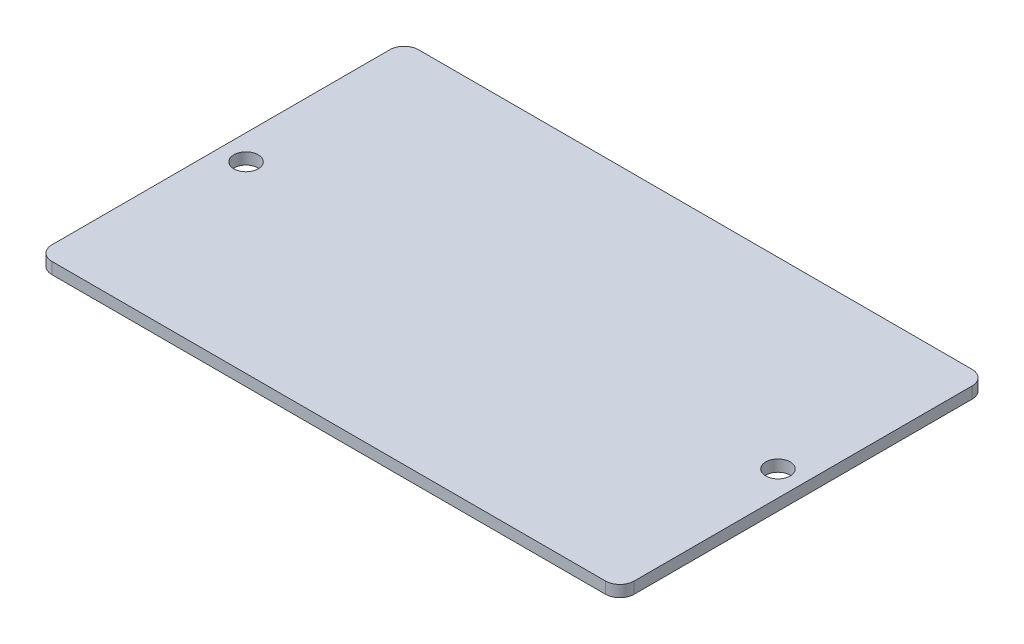
ISO-10303-21;
HEADER;
FILE_DESCRIPTION(('STEP AP214'),'2;1');
FILE_NAME('part.step','',(''),(''),'','','');
FILE_SCHEMA(('AUTOMOTIVE_DESIGN { 1 0 10303 214 1 1 1 1 }'));
ENDSEC;
DATA;
#1=APPLICATION_CONTEXT('core data for automotive mechanical design processes');
#2=APPLICATION_PROTOCOL_DEFINITION('international standard','automotive_design',2000,#1);
#3=PRODUCT_CONTEXT('',#1,'mechanical');
#4=PRODUCT('Part','Part','',(#3));
#5=PRODUCT_RELATED_PRODUCT_CATEGORY('part','',(#4));
#6=PRODUCT_DEFINITION_FORMATION('','',#4);
#7=PRODUCT_DEFINITION_CONTEXT('part definition',#1,'design');
#8=PRODUCT_DEFINITION('design','',#6,#7);
#9=PRODUCT_DEFINITION_SHAPE('','',#8);
#10=(LENGTH_UNIT() NAMED_UNIT(*) SI_UNIT(.MILLI.,.METRE.));
#11=(NAMED_UNIT(*) PLANE_ANGLE_UNIT() SI_UNIT($,.RADIAN.));
#12=(NAMED_UNIT(*) SI_UNIT($,.STERADIAN.) SOLID_ANGLE_UNIT());
#13=UNCERTAINTY_MEASURE_WITH_UNIT(LENGTH_MEASURE(1.E-05),#10,'distance_accuracy_value','');
#14=(GEOMETRIC_REPRESENTATION_CONTEXT(3) GLOBAL_UNCERTAINTY_ASSIGNED_CONTEXT((#13)) GLOBAL_UNIT_ASSIGNED_CONTEXT((#10,
#11,#12)) REPRESENTATION_CONTEXT('',''));
#15=CARTESIAN_POINT('',(0.,0.,0.));
#16=DIRECTION('',(0.,0.,1.));
#17=DIRECTION('',(1.,0.,0.));
#18=AXIS2_PLACEMENT_3D('',#15,#16,#17);
#19=CARTESIAN_POINT('',(0.,1.6,0.));
#20=DIRECTION('',(0.,1.,0.));
#21=DIRECTION('',(0.,0.,1.));
#22=AXIS2_PLACEMENT_3D('',#19,#20,#21);
#23=PLANE('',#22);
#24=CARTESIAN_POINT('',(-37.,1.6,0.));
#25=DIRECTION('',(0.,1.,0.));
#26=DIRECTION('',(0.,0.,1.));
#27=AXIS2_PLACEMENT_3D('',#24,#25,#26);
#28=CIRCLE('',#27,1.7);
#29=CARTESIAN_POINT('',(-37.,1.6,1.7));
#30=VERTEX_POINT('',#29);
#31=EDGE_CURVE('E208',#30,#30,#28,.T.);
#32=ORIENTED_EDGE('',*,*,#31,.F.);
#33=EDGE_LOOP('',(#32));
#34=FACE_BOUND('',#33,.T.);
#35=DIRECTION('',(-1.,0.,0.));
#36=VECTOR('',#35,1.);
#37=CARTESIAN_POINT('',(-40.5,1.6,-25.5));
#38=LINE('',#37,#36);
#39=CARTESIAN_POINT('',(38.5,1.6,-25.5));
#40=VERTEX_POINT('',#39);
#41=CARTESIAN_POINT('',(-38.5,1.6,-25.5));
#42=VERTEX_POINT('',#41);
#43=EDGE_CURVE('E195',#40,#42,#38,.T.);
#44=ORIENTED_EDGE('',*,*,#43,.T.);
#45=CARTESIAN_POINT('',(-38.5,1.6,-23.5));
#46=DIRECTION('',(0.,1.,0.));
#47=DIRECTION('',(0.,0.,1.));
#48=AXIS2_PLACEMENT_3D('',#45,#46,#47);
#49=CIRCLE('',#48,2.);
#50=CARTESIAN_POINT('',(-40.5,1.6,-23.5));
#51=VERTEX_POINT('',#50);
#52=EDGE_CURVE('E168',#42,#51,#49,.T.);
#53=ORIENTED_EDGE('',*,*,#52,.T.);
#54=DIRECTION('',(0.,0.,1.));
#55=VECTOR('',#54,1.);
#56=CARTESIAN_POINT('',(-40.5,1.6,-25.5));
#57=LINE('',#56,#55);
#58=CARTESIAN_POINT('',(-40.5,1.6,23.5));
#59=VERTEX_POINT('',#58);
#60=EDGE_CURVE('E125',#51,#59,#57,.T.);
#61=ORIENTED_EDGE('',*,*,#60,.T.);
#62=CARTESIAN_POINT('',(-38.5,1.6,23.5));
#63=DIRECTION('',(0.,1.,0.));
#64=DIRECTION('',(0.,0.,1.));
#65=AXIS2_PLACEMENT_3D('',#62,#63,#64);
#66=CIRCLE('',#65,2.);
#67=CARTESIAN_POINT('',(-38.5,1.6,25.5));
#68=VERTEX_POINT('',#67);
#69=EDGE_CURVE('E60',#59,#68,#66,.T.);
#70=ORIENTED_EDGE('',*,*,#69,.T.);
#71=DIRECTION('',(1.,0.,0.));
#72=VECTOR('',#71,1.);
#73=CARTESIAN_POINT('',(-40.5,1.6,25.5));
#74=LINE('',#73,#72);
#75=CARTESIAN_POINT('',(38.5,1.6,25.5));
#76=VERTEX_POINT('',#75);
#77=EDGE_CURVE('E146',#68,#76,#74,.T.);
#78=ORIENTED_EDGE('',*,*,#77,.T.);
#79=CARTESIAN_POINT('',(38.5,1.6,23.5));
#80=DIRECTION('',(0.,1.,0.));
#81=DIRECTION('',(0.,0.,1.));
#82=AXIS2_PLACEMENT_3D('',#79,#80,#81);
#83=CIRCLE('',#82,2.);
#84=CARTESIAN_POINT('',(40.5,1.6,23.5));
#85=VERTEX_POINT('',#84);
#86=EDGE_CURVE('E162',#76,#85,#83,.T.);
#87=ORIENTED_EDGE('',*,*,#86,.T.);
#88=DIRECTION('',(0.,0.,-1.));
#89=VECTOR('',#88,1.);
#90=CARTESIAN_POINT('',(40.5,1.6,-25.5));
#91=LINE('',#90,#89);
#92=CARTESIAN_POINT('',(40.5,1.6,-23.5));
#93=VERTEX_POINT('',#92);
#94=EDGE_CURVE('E139',#85,#93,#91,.T.);
#95=ORIENTED_EDGE('',*,*,#94,.T.);
#96=CARTESIAN_POINT('',(38.5,1.6,-23.5));
#97=DIRECTION('',(0.,1.,0.));
#98=DIRECTION('',(0.,0.,1.));
#99=AXIS2_PLACEMENT_3D('',#96,#97,#98);
#100=CIRCLE('',#99,2.);
#101=EDGE_CURVE('E165',#93,#40,#100,.T.);
#102=ORIENTED_EDGE('',*,*,#101,.T.);
#103=EDGE_LOOP('',(#44,#53,#61,#70,#78,#87,#95,#102));
#104=FACE_BOUND('',#103,.T.);
#105=CARTESIAN_POINT('',(37.,1.6,0.));
#106=DIRECTION('',(0.,1.,0.));
#107=DIRECTION('',(0.,0.,1.));
#108=AXIS2_PLACEMENT_3D('',#105,#106,#107);
#109=CIRCLE('',#108,1.7);
#110=CARTESIAN_POINT('',(37.,1.6,1.7));
#111=VERTEX_POINT('',#110);
#112=EDGE_CURVE('E215',#111,#111,#109,.T.);
#113=ORIENTED_EDGE('',*,*,#112,.F.);
#114=EDGE_LOOP('',(#113));
#115=FACE_BOUND('',#114,.T.);
#116=ADVANCED_FACE('F39',(#34,#104,#115),#23,.T.);
#117=CARTESIAN_POINT('',(0.,0.,0.));
#118=DIRECTION('',(0.,1.,0.));
#119=DIRECTION('',(0.,0.,1.));
#120=AXIS2_PLACEMENT_3D('',#117,#118,#119);
#121=PLANE('',#120);
#122=DIRECTION('',(0.,0.,1.));
#123=VECTOR('',#122,1.);
#124=CARTESIAN_POINT('',(-40.5,0.,-25.5));
#125=LINE('',#124,#123);
#126=CARTESIAN_POINT('',(-40.5,0.,-23.5));
#127=VERTEX_POINT('',#126);
#128=CARTESIAN_POINT('',(-40.5,0.,23.5));
#129=VERTEX_POINT('',#128);
#130=EDGE_CURVE('E123',#127,#129,#125,.T.);
#131=ORIENTED_EDGE('',*,*,#130,.F.);
#132=CARTESIAN_POINT('',(-38.5,0.,-23.5));
#133=DIRECTION('',(0.,1.,0.));
#134=DIRECTION('',(0.,0.,1.));
#135=AXIS2_PLACEMENT_3D('',#132,#133,#134);
#136=CIRCLE('',#135,2.);
#137=CARTESIAN_POINT('',(-38.5,0.,-25.5));
#138=VERTEX_POINT('',#137);
#139=EDGE_CURVE('E105',#127,#138,#136,.F.);
#140=ORIENTED_EDGE('',*,*,#139,.T.);
#141=DIRECTION('',(-1.,0.,0.));
#142=VECTOR('',#141,1.);
#143=CARTESIAN_POINT('',(-40.5,0.,-25.5));
#144=LINE('',#143,#142);
#145=CARTESIAN_POINT('',(38.5,0.,-25.5));
#146=VERTEX_POINT('',#145);
#147=EDGE_CURVE('E135',#146,#138,#144,.T.);
#148=ORIENTED_EDGE('',*,*,#147,.F.);
#149=CARTESIAN_POINT('',(38.5,0.,-23.5));
#150=DIRECTION('',(0.,1.,0.));
#151=DIRECTION('',(0.,0.,1.));
#152=AXIS2_PLACEMENT_3D('',#149,#150,#151);
#153=CIRCLE('',#152,2.);
#154=CARTESIAN_POINT('',(40.5,0.,-23.5));
#155=VERTEX_POINT('',#154);
#156=EDGE_CURVE('E117',#146,#155,#153,.F.);
#157=ORIENTED_EDGE('',*,*,#156,.T.);
#158=DIRECTION('',(0.,0.,-1.));
#159=VECTOR('',#158,1.);
#160=CARTESIAN_POINT('',(40.5,0.,-25.5));
#161=LINE('',#160,#159);
#162=CARTESIAN_POINT('',(40.5,0.,23.5));
#163=VERTEX_POINT('',#162);
#164=EDGE_CURVE('E141',#163,#155,#161,.T.);
#165=ORIENTED_EDGE('',*,*,#164,.F.);
#166=CARTESIAN_POINT('',(38.5,0.,23.5));
#167=DIRECTION('',(0.,1.,0.));
#168=DIRECTION('',(0.,0.,1.));
#169=AXIS2_PLACEMENT_3D('',#166,#167,#168);
#170=CIRCLE('',#169,2.);
#171=CARTESIAN_POINT('',(38.5,0.,25.5));
#172=VERTEX_POINT('',#171);
#173=EDGE_CURVE('E150',#163,#172,#170,.F.);
#174=ORIENTED_EDGE('',*,*,#173,.T.);
#175=DIRECTION('',(1.,0.,0.));
#176=VECTOR('',#175,1.);
#177=CARTESIAN_POINT('',(-40.5,0.,25.5));
#178=LINE('',#177,#176);
#179=CARTESIAN_POINT('',(-38.5,0.,25.5));
#180=VERTEX_POINT('',#179);
#181=EDGE_CURVE('E134',#180,#172,#178,.T.);
#182=ORIENTED_EDGE('',*,*,#181,.F.);
#183=CARTESIAN_POINT('',(-38.5,0.,23.5));
#184=DIRECTION('',(0.,1.,0.));
#185=DIRECTION('',(0.,0.,1.));
#186=AXIS2_PLACEMENT_3D('',#183,#184,#185);
#187=CIRCLE('',#186,2.);
#188=EDGE_CURVE('E127',#180,#129,#187,.F.);
#189=ORIENTED_EDGE('',*,*,#188,.T.);
#190=EDGE_LOOP('',(#131,#140,#148,#157,#165,#174,#182,#189));
#191=FACE_BOUND('',#190,.T.);
#192=CARTESIAN_POINT('',(-37.,0.,0.));
#193=DIRECTION('',(0.,1.,0.));
#194=DIRECTION('',(0.,0.,1.));
#195=AXIS2_PLACEMENT_3D('',#192,#193,#194);
#196=CIRCLE('',#195,1.7);
#197=CARTESIAN_POINT('',(-37.,0.,1.7));
#198=VERTEX_POINT('',#197);
#199=EDGE_CURVE('E201',#198,#198,#196,.T.);
#200=ORIENTED_EDGE('',*,*,#199,.T.);
#201=EDGE_LOOP('',(#200));
#202=FACE_BOUND('',#201,.T.);
#203=CARTESIAN_POINT('',(37.,0.,0.));
#204=DIRECTION('',(0.,1.,0.));
#205=DIRECTION('',(0.,0.,1.));
#206=AXIS2_PLACEMENT_3D('',#203,#204,#205);
#207=CIRCLE('',#206,1.7);
#208=CARTESIAN_POINT('',(37.,0.,1.7));
#209=VERTEX_POINT('',#208);
#210=EDGE_CURVE('E217',#209,#209,#207,.T.);
#211=ORIENTED_EDGE('',*,*,#210,.T.);
#212=EDGE_LOOP('',(#211));
#213=FACE_BOUND('',#212,.T.);
#214=ADVANCED_FACE('F130',(#191,#202,#213),#121,.F.);
#215=CARTESIAN_POINT('',(40.5,1.6,-25.5));
#216=DIRECTION('',(-1.,0.,0.));
#217=DIRECTION('',(0.,0.,1.));
#218=AXIS2_PLACEMENT_3D('',#215,#216,#217);
#219=PLANE('',#218);
#220=ORIENTED_EDGE('',*,*,#164,.T.);
#221=DIRECTION('',(0.,-1.,0.));
#222=VECTOR('',#221,1.);
#223=CARTESIAN_POINT('',(40.5,1.6,-23.5));
#224=LINE('',#223,#222);
#225=EDGE_CURVE('E175',#155,#93,#224,.F.);
#226=ORIENTED_EDGE('',*,*,#225,.T.);
#227=ORIENTED_EDGE('',*,*,#94,.F.);
#228=DIRECTION('',(0.,-1.,0.));
#229=VECTOR('',#228,1.);
#230=CARTESIAN_POINT('',(40.5,1.6,23.5));
#231=LINE('',#230,#229);
#232=EDGE_CURVE('E171',#85,#163,#231,.T.);
#233=ORIENTED_EDGE('',*,*,#232,.T.);
#234=EDGE_LOOP('',(#220,#226,#227,#233));
#235=FACE_BOUND('',#234,.T.);
#236=ADVANCED_FACE('F190',(#235),#219,.F.);
#237=CARTESIAN_POINT('',(-40.5,1.6,-25.5));
#238=DIRECTION('',(0.,0.,1.));
#239=DIRECTION('',(1.,0.,0.));
#240=AXIS2_PLACEMENT_3D('',#237,#238,#239);
#241=PLANE('',#240);
#242=ORIENTED_EDGE('',*,*,#147,.T.);
#243=DIRECTION('',(0.,-1.,0.));
#244=VECTOR('',#243,1.);
#245=CARTESIAN_POINT('',(-38.5,1.6,-25.5));
#246=LINE('',#245,#244);
#247=EDGE_CURVE('E110',#138,#42,#246,.F.);
#248=ORIENTED_EDGE('',*,*,#247,.T.);
#249=ORIENTED_EDGE('',*,*,#43,.F.);
#250=DIRECTION('',(0.,-1.,0.));
#251=VECTOR('',#250,1.);
#252=CARTESIAN_POINT('',(38.5,1.6,-25.5));
#253=LINE('',#252,#251);
#254=EDGE_CURVE('E116',#40,#146,#253,.T.);
#255=ORIENTED_EDGE('',*,*,#254,.T.);
#256=EDGE_LOOP('',(#242,#248,#249,#255));
#257=FACE_BOUND('',#256,.T.);
#258=ADVANCED_FACE('F243',(#257),#241,.F.);
#259=CARTESIAN_POINT('',(-40.5,1.6,-25.5));
#260=DIRECTION('',(1.,0.,0.));
#261=DIRECTION('',(0.,0.,-1.));
#262=AXIS2_PLACEMENT_3D('',#259,#260,#261);
#263=PLANE('',#262);
#264=ORIENTED_EDGE('',*,*,#60,.F.);
#265=DIRECTION('',(0.,-1.,0.));
#266=VECTOR('',#265,1.);
#267=CARTESIAN_POINT('',(-40.5,1.6,-23.5));
#268=LINE('',#267,#266);
#269=EDGE_CURVE('E109',#51,#127,#268,.T.);
#270=ORIENTED_EDGE('',*,*,#269,.T.);
#271=ORIENTED_EDGE('',*,*,#130,.T.);
#272=DIRECTION('',(0.,-1.,0.));
#273=VECTOR('',#272,1.);
#274=CARTESIAN_POINT('',(-40.5,1.6,23.5));
#275=LINE('',#274,#273);
#276=EDGE_CURVE('E128',#129,#59,#275,.F.);
#277=ORIENTED_EDGE('',*,*,#276,.T.);
#278=EDGE_LOOP('',(#264,#270,#271,#277));
#279=FACE_BOUND('',#278,.T.);
#280=ADVANCED_FACE('F122',(#279),#263,.F.);
#281=CARTESIAN_POINT('',(-40.5,1.6,25.5));
#282=DIRECTION('',(0.,0.,-1.));
#283=DIRECTION('',(-1.,0.,0.));
#284=AXIS2_PLACEMENT_3D('',#281,#282,#283);
#285=PLANE('',#284);
#286=ORIENTED_EDGE('',*,*,#181,.T.);
#287=DIRECTION('',(0.,-1.,0.));
#288=VECTOR('',#287,1.);
#289=CARTESIAN_POINT('',(38.5,1.6,25.5));
#290=LINE('',#289,#288);
#291=EDGE_CURVE('E11',#172,#76,#290,.F.);
#292=ORIENTED_EDGE('',*,*,#291,.T.);
#293=ORIENTED_EDGE('',*,*,#77,.F.);
#294=DIRECTION('',(0.,-1.,0.));
#295=VECTOR('',#294,1.);
#296=CARTESIAN_POINT('',(-38.5,1.6,25.5));
#297=LINE('',#296,#295);
#298=EDGE_CURVE('E48',#68,#180,#297,.T.);
#299=ORIENTED_EDGE('',*,*,#298,.T.);
#300=EDGE_LOOP('',(#286,#292,#293,#299));
#301=FACE_BOUND('',#300,.T.);
#302=ADVANCED_FACE('F180',(#301),#285,.F.);
#303=CARTESIAN_POINT('',(-37.,1.6,0.));
#304=DIRECTION('',(0.,-1.,0.));
#305=DIRECTION('',(0.,0.,-1.));
#306=AXIS2_PLACEMENT_3D('',#303,#304,#305);
#307=CYLINDRICAL_SURFACE('',#306,1.7);
#308=ORIENTED_EDGE('',*,*,#31,.T.);
#309=EDGE_LOOP('',(#308));
#310=FACE_BOUND('',#309,.T.);
#311=ORIENTED_EDGE('',*,*,#199,.F.);
#312=EDGE_LOOP('',(#311));
#313=FACE_BOUND('',#312,.T.);
#314=ADVANCED_FACE('F236',(#310,#313),#307,.F.);
#315=CARTESIAN_POINT('',(37.,1.6,0.));
#316=DIRECTION('',(0.,-1.,0.));
#317=DIRECTION('',(0.,0.,-1.));
#318=AXIS2_PLACEMENT_3D('',#315,#316,#317);
#319=CYLINDRICAL_SURFACE('',#318,1.7);
#320=ORIENTED_EDGE('',*,*,#112,.T.);
#321=EDGE_LOOP('',(#320));
#322=FACE_BOUND('',#321,.T.);
#323=ORIENTED_EDGE('',*,*,#210,.F.);
#324=EDGE_LOOP('',(#323));
#325=FACE_BOUND('',#324,.T.);
#326=ADVANCED_FACE('F225',(#322,#325),#319,.F.);
#327=CARTESIAN_POINT('',(-38.5,1.6,-23.5));
#328=DIRECTION('',(0.,-1.,0.));
#329=DIRECTION('',(0.,0.,-1.));
#330=AXIS2_PLACEMENT_3D('',#327,#328,#329);
#331=CYLINDRICAL_SURFACE('',#330,2.);
#332=ORIENTED_EDGE('',*,*,#52,.F.);
#333=ORIENTED_EDGE('',*,*,#247,.F.);
#334=ORIENTED_EDGE('',*,*,#139,.F.);
#335=ORIENTED_EDGE('',*,*,#269,.F.);
#336=EDGE_LOOP('',(#332,#333,#334,#335));
#337=FACE_BOUND('',#336,.T.);
#338=ADVANCED_FACE('F108',(#337),#331,.T.);
#339=CARTESIAN_POINT('',(38.5,1.6,-23.5));
#340=DIRECTION('',(0.,-1.,0.));
#341=DIRECTION('',(0.,0.,-1.));
#342=AXIS2_PLACEMENT_3D('',#339,#340,#341);
#343=CYLINDRICAL_SURFACE('',#342,2.);
#344=ORIENTED_EDGE('',*,*,#101,.F.);
#345=ORIENTED_EDGE('',*,*,#225,.F.);
#346=ORIENTED_EDGE('',*,*,#156,.F.);
#347=ORIENTED_EDGE('',*,*,#254,.F.);
#348=EDGE_LOOP('',(#344,#345,#346,#347));
#349=FACE_BOUND('',#348,.T.);
#350=ADVANCED_FACE('F251',(#349),#343,.T.);
#351=CARTESIAN_POINT('',(38.5,1.6,23.5));
#352=DIRECTION('',(0.,-1.,0.));
#353=DIRECTION('',(0.,0.,-1.));
#354=AXIS2_PLACEMENT_3D('',#351,#352,#353);
#355=CYLINDRICAL_SURFACE('',#354,2.);
#356=ORIENTED_EDGE('',*,*,#86,.F.);
#357=ORIENTED_EDGE('',*,*,#291,.F.);
#358=ORIENTED_EDGE('',*,*,#173,.F.);
#359=ORIENTED_EDGE('',*,*,#232,.F.);
#360=EDGE_LOOP('',(#356,#357,#358,#359));
#361=FACE_BOUND('',#360,.T.);
#362=ADVANCED_FACE('F187',(#361),#355,.T.);
#363=CARTESIAN_POINT('',(-38.5,1.6,23.5));
#364=DIRECTION('',(0.,-1.,0.));
#365=DIRECTION('',(0.,0.,-1.));
#366=AXIS2_PLACEMENT_3D('',#363,#364,#365);
#367=CYLINDRICAL_SURFACE('',#366,2.);
#368=ORIENTED_EDGE('',*,*,#69,.F.);
#369=ORIENTED_EDGE('',*,*,#276,.F.);
#370=ORIENTED_EDGE('',*,*,#188,.F.);
#371=ORIENTED_EDGE('',*,*,#298,.F.);
#372=EDGE_LOOP('',(#368,#369,#370,#371));
#373=FACE_BOUND('',#372,.T.);
#374=ADVANCED_FACE('F41',(#373),#367,.T.);
#375=CLOSED_SHELL('',(#116,#214,#236,#258,#280,#302,#314,#326,#338,#350,#362,#374));
#376=MANIFOLD_SOLID_BREP('B2',#375);
#377=ADVANCED_BREP_SHAPE_REPRESENTATION('',(#18,#376),#14);
#378=SHAPE_DEFINITION_REPRESENTATION(#9,#377);
ENDSEC;
END-ISO-10303-21;
